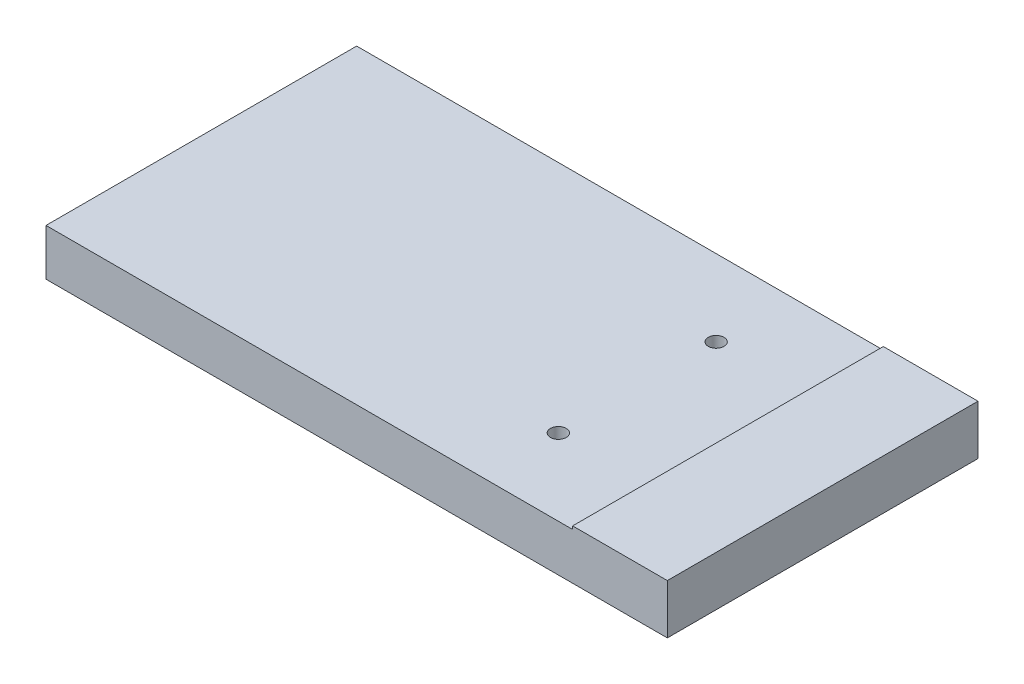
ISO-10303-21;
HEADER;
FILE_DESCRIPTION(('STEP AP214'),'2;1');
FILE_NAME('part.step','',(''),(''),'','','');
FILE_SCHEMA(('AUTOMOTIVE_DESIGN { 1 0 10303 214 1 1 1 1 }'));
ENDSEC;
DATA;
#1=APPLICATION_CONTEXT('core data for automotive mechanical design processes');
#2=APPLICATION_PROTOCOL_DEFINITION('international standard','automotive_design',2000,#1);
#3=PRODUCT_CONTEXT('',#1,'mechanical');
#4=PRODUCT('Part','Part','',(#3));
#5=PRODUCT_RELATED_PRODUCT_CATEGORY('part','',(#4));
#6=PRODUCT_DEFINITION_FORMATION('','',#4);
#7=PRODUCT_DEFINITION_CONTEXT('part definition',#1,'design');
#8=PRODUCT_DEFINITION('design','',#6,#7);
#9=PRODUCT_DEFINITION_SHAPE('','',#8);
#10=(LENGTH_UNIT() NAMED_UNIT(*) SI_UNIT(.MILLI.,.METRE.));
#11=(NAMED_UNIT(*) PLANE_ANGLE_UNIT() SI_UNIT($,.RADIAN.));
#12=(NAMED_UNIT(*) SI_UNIT($,.STERADIAN.) SOLID_ANGLE_UNIT());
#13=UNCERTAINTY_MEASURE_WITH_UNIT(LENGTH_MEASURE(1.E-05),#10,'distance_accuracy_value','');
#14=(GEOMETRIC_REPRESENTATION_CONTEXT(3) GLOBAL_UNCERTAINTY_ASSIGNED_CONTEXT((#13)) GLOBAL_UNIT_ASSIGNED_CONTEXT((#10,
#11,#12)) REPRESENTATION_CONTEXT('',''));
#15=CARTESIAN_POINT('',(0.,0.,0.));
#16=DIRECTION('',(0.,0.,1.));
#17=DIRECTION('',(1.,0.,0.));
#18=AXIS2_PLACEMENT_3D('',#15,#16,#17);
#19=CARTESIAN_POINT('',(0.,150.,0.));
#20=DIRECTION('',(0.,-1.,0.));
#21=DIRECTION('',(0.,0.,-1.));
#22=AXIS2_PLACEMENT_3D('',#19,#20,#21);
#23=PLANE('',#22);
#24=CARTESIAN_POINT('',(403.1,150.,254.));
#25=DIRECTION('',(0.,-1.,0.));
#26=DIRECTION('',(0.,0.,-1.));
#27=AXIS2_PLACEMENT_3D('',#24,#25,#26);
#28=CIRCLE('',#27,25.4);
#29=CARTESIAN_POINT('',(403.1,150.,228.6));
#30=VERTEX_POINT('',#29);
#31=EDGE_CURVE('E163',#30,#30,#28,.T.);
#32=ORIENTED_EDGE('',*,*,#31,.T.);
#33=EDGE_LOOP('',(#32));
#34=FACE_BOUND('',#33,.T.);
#35=CARTESIAN_POINT('',(403.1,150.,-254.));
#36=DIRECTION('',(0.,-1.,0.));
#37=DIRECTION('',(0.,0.,-1.));
#38=AXIS2_PLACEMENT_3D('',#35,#36,#37);
#39=CIRCLE('',#38,25.4);
#40=CARTESIAN_POINT('',(403.1,150.,-279.4));
#41=VERTEX_POINT('',#40);
#42=EDGE_CURVE('E271',#41,#41,#39,.T.);
#43=ORIENTED_EDGE('',*,*,#42,.T.);
#44=EDGE_LOOP('',(#43));
#45=FACE_BOUND('',#44,.T.);
#46=DIRECTION('',(0.,0.,1.));
#47=VECTOR('',#46,1.);
#48=CARTESIAN_POINT('',(695.2,150.,500.));
#49=LINE('',#48,#47);
#50=CARTESIAN_POINT('',(695.2,150.,-500.));
#51=VERTEX_POINT('',#50);
#52=CARTESIAN_POINT('',(695.2,150.,500.));
#53=VERTEX_POINT('',#52);
#54=EDGE_CURVE('E57',#51,#53,#49,.T.);
#55=ORIENTED_EDGE('',*,*,#54,.F.);
#56=DIRECTION('',(-1.,0.,0.));
#57=VECTOR('',#56,1.);
#58=CARTESIAN_POINT('',(-1000.,150.,-500.));
#59=LINE('',#58,#57);
#60=CARTESIAN_POINT('',(-1000.,150.,-500.));
#61=VERTEX_POINT('',#60);
#62=EDGE_CURVE('E95',#51,#61,#59,.T.);
#63=ORIENTED_EDGE('',*,*,#62,.T.);
#64=DIRECTION('',(0.,0.,1.));
#65=VECTOR('',#64,1.);
#66=CARTESIAN_POINT('',(-1000.,150.,500.));
#67=LINE('',#66,#65);
#68=CARTESIAN_POINT('',(-1000.,150.,500.));
#69=VERTEX_POINT('',#68);
#70=EDGE_CURVE('E63',#61,#69,#67,.T.);
#71=ORIENTED_EDGE('',*,*,#70,.T.);
#72=DIRECTION('',(1.,0.,0.));
#73=VECTOR('',#72,1.);
#74=CARTESIAN_POINT('',(-1000.,150.,500.));
#75=LINE('',#74,#73);
#76=EDGE_CURVE('E106',#69,#53,#75,.T.);
#77=ORIENTED_EDGE('',*,*,#76,.T.);
#78=EDGE_LOOP('',(#55,#63,#71,#77));
#79=FACE_BOUND('',#78,.T.);
#80=ADVANCED_FACE('F41',(#34,#45,#79),#23,.F.);
#81=CARTESIAN_POINT('',(1000.,150.,500.));
#82=DIRECTION('',(-1.,0.,0.));
#83=DIRECTION('',(0.,0.,1.));
#84=AXIS2_PLACEMENT_3D('',#81,#82,#83);
#85=PLANE('',#84);
#86=DIRECTION('',(0.,0.,-1.));
#87=VECTOR('',#86,1.);
#88=CARTESIAN_POINT('',(1000.,0.,500.));
#89=LINE('',#88,#87);
#90=CARTESIAN_POINT('',(1000.,0.,500.));
#91=VERTEX_POINT('',#90);
#92=CARTESIAN_POINT('',(1000.,0.,-500.));
#93=VERTEX_POINT('',#92);
#94=EDGE_CURVE('E102',#91,#93,#89,.T.);
#95=ORIENTED_EDGE('',*,*,#94,.T.);
#96=DIRECTION('',(0.,-1.,0.));
#97=VECTOR('',#96,1.);
#98=CARTESIAN_POINT('',(1000.,150.,-500.));
#99=LINE('',#98,#97);
#100=CARTESIAN_POINT('',(1000.,160.,-500.));
#101=VERTEX_POINT('',#100);
#102=EDGE_CURVE('E11',#101,#93,#99,.T.);
#103=ORIENTED_EDGE('',*,*,#102,.F.);
#104=DIRECTION('',(0.,0.,-1.));
#105=VECTOR('',#104,1.);
#106=CARTESIAN_POINT('',(1000.,160.,500.));
#107=LINE('',#106,#105);
#108=CARTESIAN_POINT('',(1000.,160.,500.));
#109=VERTEX_POINT('',#108);
#110=EDGE_CURVE('E104',#109,#101,#107,.T.);
#111=ORIENTED_EDGE('',*,*,#110,.F.);
#112=DIRECTION('',(0.,-1.,0.));
#113=VECTOR('',#112,1.);
#114=CARTESIAN_POINT('',(1000.,150.,500.));
#115=LINE('',#114,#113);
#116=EDGE_CURVE('E87',#109,#91,#115,.T.);
#117=ORIENTED_EDGE('',*,*,#116,.T.);
#118=EDGE_LOOP('',(#95,#103,#111,#117));
#119=FACE_BOUND('',#118,.T.);
#120=ADVANCED_FACE('F43',(#119),#85,.F.);
#121=CARTESIAN_POINT('',(-1000.,150.,-500.));
#122=DIRECTION('',(0.,0.,1.));
#123=DIRECTION('',(1.,0.,0.));
#124=AXIS2_PLACEMENT_3D('',#121,#122,#123);
#125=PLANE('',#124);
#126=DIRECTION('',(-1.,0.,0.));
#127=VECTOR('',#126,1.);
#128=CARTESIAN_POINT('',(-1000.,0.,-500.));
#129=LINE('',#128,#127);
#130=CARTESIAN_POINT('',(-1000.,0.,-500.));
#131=VERTEX_POINT('',#130);
#132=EDGE_CURVE('E109',#93,#131,#129,.T.);
#133=ORIENTED_EDGE('',*,*,#132,.T.);
#134=DIRECTION('',(0.,-1.,0.));
#135=VECTOR('',#134,1.);
#136=CARTESIAN_POINT('',(-1000.,150.,-500.));
#137=LINE('',#136,#135);
#138=EDGE_CURVE('E50',#61,#131,#137,.T.);
#139=ORIENTED_EDGE('',*,*,#138,.F.);
#140=ORIENTED_EDGE('',*,*,#62,.F.);
#141=DIRECTION('',(0.,-1.,0.));
#142=VECTOR('',#141,1.);
#143=CARTESIAN_POINT('',(695.2,160.,-500.));
#144=LINE('',#143,#142);
#145=CARTESIAN_POINT('',(695.2,160.,-500.));
#146=VERTEX_POINT('',#145);
#147=EDGE_CURVE('E111',#146,#51,#144,.T.);
#148=ORIENTED_EDGE('',*,*,#147,.F.);
#149=DIRECTION('',(-1.,0.,0.));
#150=VECTOR('',#149,1.);
#151=CARTESIAN_POINT('',(695.2,160.,-500.));
#152=LINE('',#151,#150);
#153=EDGE_CURVE('E136',#101,#146,#152,.T.);
#154=ORIENTED_EDGE('',*,*,#153,.F.);
#155=ORIENTED_EDGE('',*,*,#102,.T.);
#156=EDGE_LOOP('',(#133,#139,#140,#148,#154,#155));
#157=FACE_BOUND('',#156,.T.);
#158=ADVANCED_FACE('F131',(#157),#125,.F.);
#159=CARTESIAN_POINT('',(-1000.,150.,500.));
#160=DIRECTION('',(1.,0.,0.));
#161=DIRECTION('',(0.,0.,-1.));
#162=AXIS2_PLACEMENT_3D('',#159,#160,#161);
#163=PLANE('',#162);
#164=DIRECTION('',(0.,0.,1.));
#165=VECTOR('',#164,1.);
#166=CARTESIAN_POINT('',(-1000.,0.,500.));
#167=LINE('',#166,#165);
#168=CARTESIAN_POINT('',(-1000.,0.,500.));
#169=VERTEX_POINT('',#168);
#170=EDGE_CURVE('E96',#131,#169,#167,.T.);
#171=ORIENTED_EDGE('',*,*,#170,.T.);
#172=DIRECTION('',(0.,-1.,0.));
#173=VECTOR('',#172,1.);
#174=CARTESIAN_POINT('',(-1000.,150.,500.));
#175=LINE('',#174,#173);
#176=EDGE_CURVE('E90',#69,#169,#175,.T.);
#177=ORIENTED_EDGE('',*,*,#176,.F.);
#178=ORIENTED_EDGE('',*,*,#70,.F.);
#179=ORIENTED_EDGE('',*,*,#138,.T.);
#180=EDGE_LOOP('',(#171,#177,#178,#179));
#181=FACE_BOUND('',#180,.T.);
#182=ADVANCED_FACE('F129',(#181),#163,.F.);
#183=CARTESIAN_POINT('',(-1000.,150.,500.));
#184=DIRECTION('',(0.,0.,-1.));
#185=DIRECTION('',(-1.,0.,0.));
#186=AXIS2_PLACEMENT_3D('',#183,#184,#185);
#187=PLANE('',#186);
#188=DIRECTION('',(1.,0.,0.));
#189=VECTOR('',#188,1.);
#190=CARTESIAN_POINT('',(-1000.,0.,500.));
#191=LINE('',#190,#189);
#192=EDGE_CURVE('E83',#169,#91,#191,.T.);
#193=ORIENTED_EDGE('',*,*,#192,.T.);
#194=ORIENTED_EDGE('',*,*,#116,.F.);
#195=DIRECTION('',(1.,0.,0.));
#196=VECTOR('',#195,1.);
#197=CARTESIAN_POINT('',(695.2,160.,500.));
#198=LINE('',#197,#196);
#199=CARTESIAN_POINT('',(695.2,160.,500.));
#200=VERTEX_POINT('',#199);
#201=EDGE_CURVE('E150',#200,#109,#198,.T.);
#202=ORIENTED_EDGE('',*,*,#201,.F.);
#203=DIRECTION('',(0.,-1.,0.));
#204=VECTOR('',#203,1.);
#205=CARTESIAN_POINT('',(695.2,160.,500.));
#206=LINE('',#205,#204);
#207=EDGE_CURVE('E117',#200,#53,#206,.T.);
#208=ORIENTED_EDGE('',*,*,#207,.T.);
#209=ORIENTED_EDGE('',*,*,#76,.F.);
#210=ORIENTED_EDGE('',*,*,#176,.T.);
#211=EDGE_LOOP('',(#193,#194,#202,#208,#209,#210));
#212=FACE_BOUND('',#211,.T.);
#213=ADVANCED_FACE('F85',(#212),#187,.F.);
#214=CARTESIAN_POINT('',(0.,0.,0.));
#215=DIRECTION('',(0.,-1.,0.));
#216=DIRECTION('',(0.,0.,-1.));
#217=AXIS2_PLACEMENT_3D('',#214,#215,#216);
#218=PLANE('',#217);
#219=CARTESIAN_POINT('',(403.1,0.,254.));
#220=DIRECTION('',(0.,-1.,0.));
#221=DIRECTION('',(0.,0.,-1.));
#222=AXIS2_PLACEMENT_3D('',#219,#220,#221);
#223=CIRCLE('',#222,25.4);
#224=CARTESIAN_POINT('',(403.1,0.,228.6));
#225=VERTEX_POINT('',#224);
#226=EDGE_CURVE('E268',#225,#225,#223,.T.);
#227=ORIENTED_EDGE('',*,*,#226,.F.);
#228=EDGE_LOOP('',(#227));
#229=FACE_BOUND('',#228,.T.);
#230=CARTESIAN_POINT('',(403.1,0.,-254.));
#231=DIRECTION('',(0.,-1.,0.));
#232=DIRECTION('',(0.,0.,1.));
#233=AXIS2_PLACEMENT_3D('',#230,#231,#232);
#234=CIRCLE('',#233,25.4);
#235=CARTESIAN_POINT('',(403.1,0.,-228.6));
#236=VERTEX_POINT('',#235);
#237=EDGE_CURVE('E280',#236,#236,#234,.T.);
#238=ORIENTED_EDGE('',*,*,#237,.F.);
#239=EDGE_LOOP('',(#238));
#240=FACE_BOUND('',#239,.T.);
#241=ORIENTED_EDGE('',*,*,#94,.F.);
#242=ORIENTED_EDGE('',*,*,#192,.F.);
#243=ORIENTED_EDGE('',*,*,#170,.F.);
#244=ORIENTED_EDGE('',*,*,#132,.F.);
#245=EDGE_LOOP('',(#241,#242,#243,#244));
#246=FACE_BOUND('',#245,.T.);
#247=ADVANCED_FACE('F108',(#229,#240,#246),#218,.T.);
#248=CARTESIAN_POINT('',(695.2,160.,500.));
#249=DIRECTION('',(1.,0.,0.));
#250=DIRECTION('',(0.,0.,-1.));
#251=AXIS2_PLACEMENT_3D('',#248,#249,#250);
#252=PLANE('',#251);
#253=ORIENTED_EDGE('',*,*,#54,.T.);
#254=ORIENTED_EDGE('',*,*,#207,.F.);
#255=DIRECTION('',(0.,0.,1.));
#256=VECTOR('',#255,1.);
#257=CARTESIAN_POINT('',(695.2,160.,500.));
#258=LINE('',#257,#256);
#259=EDGE_CURVE('E147',#146,#200,#258,.T.);
#260=ORIENTED_EDGE('',*,*,#259,.F.);
#261=ORIENTED_EDGE('',*,*,#147,.T.);
#262=EDGE_LOOP('',(#253,#254,#260,#261));
#263=FACE_BOUND('',#262,.T.);
#264=ADVANCED_FACE('F155',(#263),#252,.F.);
#265=CARTESIAN_POINT('',(0.,160.,0.));
#266=DIRECTION('',(0.,-1.,0.));
#267=DIRECTION('',(0.,0.,-1.));
#268=AXIS2_PLACEMENT_3D('',#265,#266,#267);
#269=PLANE('',#268);
#270=ORIENTED_EDGE('',*,*,#110,.T.);
#271=ORIENTED_EDGE('',*,*,#153,.T.);
#272=ORIENTED_EDGE('',*,*,#259,.T.);
#273=ORIENTED_EDGE('',*,*,#201,.T.);
#274=EDGE_LOOP('',(#270,#271,#272,#273));
#275=FACE_BOUND('',#274,.T.);
#276=ADVANCED_FACE('F149',(#275),#269,.F.);
#277=CARTESIAN_POINT('',(403.1,160.,-254.));
#278=DIRECTION('',(0.,-1.,0.));
#279=DIRECTION('',(0.,0.,-1.));
#280=AXIS2_PLACEMENT_3D('',#277,#278,#279);
#281=CYLINDRICAL_SURFACE('',#280,25.4);
#282=ORIENTED_EDGE('',*,*,#237,.T.);
#283=EDGE_LOOP('',(#282));
#284=FACE_BOUND('',#283,.T.);
#285=ORIENTED_EDGE('',*,*,#42,.F.);
#286=EDGE_LOOP('',(#285));
#287=FACE_BOUND('',#286,.T.);
#288=ADVANCED_FACE('F215',(#284,#287),#281,.F.);
#289=CARTESIAN_POINT('',(403.1,160.,254.));
#290=DIRECTION('',(0.,-1.,0.));
#291=DIRECTION('',(0.,0.,-1.));
#292=AXIS2_PLACEMENT_3D('',#289,#290,#291);
#293=CYLINDRICAL_SURFACE('',#292,25.4);
#294=ORIENTED_EDGE('',*,*,#226,.T.);
#295=EDGE_LOOP('',(#294));
#296=FACE_BOUND('',#295,.T.);
#297=ORIENTED_EDGE('',*,*,#31,.F.);
#298=EDGE_LOOP('',(#297));
#299=FACE_BOUND('',#298,.T.);
#300=ADVANCED_FACE('F219',(#296,#299),#293,.F.);
#301=CLOSED_SHELL('',(#80,#120,#158,#182,#213,#247,#264,#276,#288,#300));
#302=MANIFOLD_SOLID_BREP('B2',#301);
#303=ADVANCED_BREP_SHAPE_REPRESENTATION('',(#18,#302),#14);
#304=SHAPE_DEFINITION_REPRESENTATION(#9,#303);
ENDSEC;
END-ISO-10303-21;
